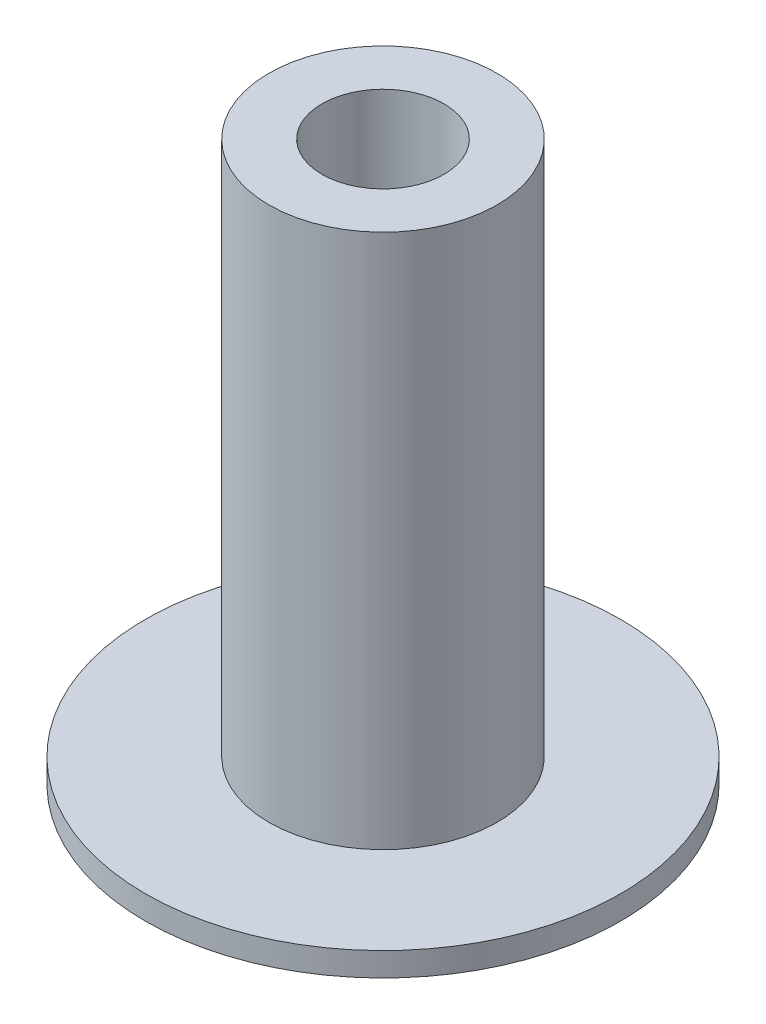
ISO-10303-21;
HEADER;
FILE_DESCRIPTION(('STEP AP214'),'2;1');
FILE_NAME('part.step','',(''),(''),'','','');
FILE_SCHEMA(('AUTOMOTIVE_DESIGN { 1 0 10303 214 1 1 1 1 }'));
ENDSEC;
DATA;
#1=APPLICATION_CONTEXT('core data for automotive mechanical design processes');
#2=APPLICATION_PROTOCOL_DEFINITION('international standard','automotive_design',2000,#1);
#3=PRODUCT_CONTEXT('',#1,'mechanical');
#4=PRODUCT('Part','Part','',(#3));
#5=PRODUCT_RELATED_PRODUCT_CATEGORY('part','',(#4));
#6=PRODUCT_DEFINITION_FORMATION('','',#4);
#7=PRODUCT_DEFINITION_CONTEXT('part definition',#1,'design');
#8=PRODUCT_DEFINITION('design','',#6,#7);
#9=PRODUCT_DEFINITION_SHAPE('','',#8);
#10=(LENGTH_UNIT() NAMED_UNIT(*) SI_UNIT(.MILLI.,.METRE.));
#11=(NAMED_UNIT(*) PLANE_ANGLE_UNIT() SI_UNIT($,.RADIAN.));
#12=(NAMED_UNIT(*) SI_UNIT($,.STERADIAN.) SOLID_ANGLE_UNIT());
#13=UNCERTAINTY_MEASURE_WITH_UNIT(LENGTH_MEASURE(1.E-05),#10,'distance_accuracy_value','');
#14=(GEOMETRIC_REPRESENTATION_CONTEXT(3) GLOBAL_UNCERTAINTY_ASSIGNED_CONTEXT((#13)) GLOBAL_UNIT_ASSIGNED_CONTEXT((#10,
#11,#12)) REPRESENTATION_CONTEXT('',''));
#15=CARTESIAN_POINT('',(0.,0.,0.));
#16=DIRECTION('',(0.,0.,1.));
#17=DIRECTION('',(1.,0.,0.));
#18=AXIS2_PLACEMENT_3D('',#15,#16,#17);
#19=CARTESIAN_POINT('',(0.,1.27,0.));
#20=DIRECTION('',(0.,-1.,0.));
#21=DIRECTION('',(0.,0.,-1.));
#22=AXIS2_PLACEMENT_3D('',#19,#20,#21);
#23=CYLINDRICAL_SURFACE('',#22,12.7);
#24=CARTESIAN_POINT('',(0.,1.27,0.));
#25=DIRECTION('',(0.,1.,0.));
#26=DIRECTION('',(0.,0.,1.));
#27=AXIS2_PLACEMENT_3D('',#24,#25,#26);
#28=CIRCLE('',#27,12.7);
#29=CARTESIAN_POINT('',(0.,1.27,12.7));
#30=VERTEX_POINT('',#29);
#31=EDGE_CURVE('E49',#30,#30,#28,.T.);
#32=ORIENTED_EDGE('',*,*,#31,.F.);
#33=EDGE_LOOP('',(#32));
#34=FACE_BOUND('',#33,.T.);
#35=CARTESIAN_POINT('',(0.,0.,0.));
#36=DIRECTION('',(0.,1.,0.));
#37=DIRECTION('',(0.,0.,1.));
#38=AXIS2_PLACEMENT_3D('',#35,#36,#37);
#39=CIRCLE('',#38,12.7);
#40=CARTESIAN_POINT('',(0.,0.,12.7));
#41=VERTEX_POINT('',#40);
#42=EDGE_CURVE('E44',#41,#41,#39,.T.);
#43=ORIENTED_EDGE('',*,*,#42,.T.);
#44=EDGE_LOOP('',(#43));
#45=FACE_BOUND('',#44,.T.);
#46=ADVANCED_FACE('F41',(#34,#45),#23,.T.);
#47=CARTESIAN_POINT('',(0.,1.27,0.));
#48=DIRECTION('',(0.,1.,0.));
#49=DIRECTION('',(0.,0.,1.));
#50=AXIS2_PLACEMENT_3D('',#47,#48,#49);
#51=PLANE('',#50);
#52=CARTESIAN_POINT('',(0.,1.27,0.));
#53=DIRECTION('',(0.,1.,0.));
#54=DIRECTION('',(0.,0.,1.));
#55=AXIS2_PLACEMENT_3D('',#52,#53,#54);
#56=CIRCLE('',#55,6.096);
#57=CARTESIAN_POINT('',(0.,1.27,6.096));
#58=VERTEX_POINT('',#57);
#59=EDGE_CURVE('E10',#58,#58,#56,.T.);
#60=ORIENTED_EDGE('',*,*,#59,.F.);
#61=EDGE_LOOP('',(#60));
#62=FACE_BOUND('',#61,.T.);
#63=ORIENTED_EDGE('',*,*,#31,.T.);
#64=EDGE_LOOP('',(#63));
#65=FACE_BOUND('',#64,.T.);
#66=ADVANCED_FACE('F84',(#62,#65),#51,.T.);
#67=CARTESIAN_POINT('',(0.,0.,0.));
#68=DIRECTION('',(0.,1.,0.));
#69=DIRECTION('',(0.,0.,1.));
#70=AXIS2_PLACEMENT_3D('',#67,#68,#69);
#71=PLANE('',#70);
#72=CARTESIAN_POINT('',(0.,0.,0.));
#73=DIRECTION('',(0.,1.,0.));
#74=DIRECTION('',(0.,0.,1.));
#75=AXIS2_PLACEMENT_3D('',#72,#73,#74);
#76=CIRCLE('',#75,3.26389999999999);
#77=CARTESIAN_POINT('',(0.,0.,3.26389999999999));
#78=VERTEX_POINT('',#77);
#79=EDGE_CURVE('E60',#78,#78,#76,.T.);
#80=ORIENTED_EDGE('',*,*,#79,.T.);
#81=EDGE_LOOP('',(#80));
#82=FACE_BOUND('',#81,.T.);
#83=ORIENTED_EDGE('',*,*,#42,.F.);
#84=EDGE_LOOP('',(#83));
#85=FACE_BOUND('',#84,.T.);
#86=ADVANCED_FACE('F79',(#82,#85),#71,.F.);
#87=CARTESIAN_POINT('',(0.,29.845,0.));
#88=DIRECTION('',(0.,-1.,0.));
#89=DIRECTION('',(0.,0.,-1.));
#90=AXIS2_PLACEMENT_3D('',#87,#88,#89);
#91=CYLINDRICAL_SURFACE('',#90,6.096);
#92=CARTESIAN_POINT('',(0.,29.845,0.));
#93=DIRECTION('',(0.,1.,0.));
#94=DIRECTION('',(0.,0.,1.));
#95=AXIS2_PLACEMENT_3D('',#92,#93,#94);
#96=CIRCLE('',#95,6.096);
#97=CARTESIAN_POINT('',(0.,29.845,6.096));
#98=VERTEX_POINT('',#97);
#99=EDGE_CURVE('E56',#98,#98,#96,.T.);
#100=ORIENTED_EDGE('',*,*,#99,.F.);
#101=EDGE_LOOP('',(#100));
#102=FACE_BOUND('',#101,.T.);
#103=ORIENTED_EDGE('',*,*,#59,.T.);
#104=EDGE_LOOP('',(#103));
#105=FACE_BOUND('',#104,.T.);
#106=ADVANCED_FACE('F74',(#102,#105),#91,.T.);
#107=CARTESIAN_POINT('',(0.,29.845,0.));
#108=DIRECTION('',(0.,1.,0.));
#109=DIRECTION('',(0.,0.,1.));
#110=AXIS2_PLACEMENT_3D('',#107,#108,#109);
#111=PLANE('',#110);
#112=CARTESIAN_POINT('',(0.,29.845,0.));
#113=DIRECTION('',(0.,1.,0.));
#114=DIRECTION('',(0.,0.,1.));
#115=AXIS2_PLACEMENT_3D('',#112,#113,#114);
#116=CIRCLE('',#115,3.26389999999999);
#117=CARTESIAN_POINT('',(0.,29.845,3.26389999999999));
#118=VERTEX_POINT('',#117);
#119=EDGE_CURVE('E64',#118,#118,#116,.T.);
#120=ORIENTED_EDGE('',*,*,#119,.F.);
#121=EDGE_LOOP('',(#120));
#122=FACE_BOUND('',#121,.T.);
#123=ORIENTED_EDGE('',*,*,#99,.T.);
#124=EDGE_LOOP('',(#123));
#125=FACE_BOUND('',#124,.T.);
#126=ADVANCED_FACE('F71',(#122,#125),#111,.T.);
#127=CARTESIAN_POINT('',(0.,29.845,0.));
#128=DIRECTION('',(0.,1.,0.));
#129=DIRECTION('',(0.,0.,1.));
#130=AXIS2_PLACEMENT_3D('',#127,#128,#129);
#131=CYLINDRICAL_SURFACE('',#130,3.26389999999999);
#132=ORIENTED_EDGE('',*,*,#79,.F.);
#133=EDGE_LOOP('',(#132));
#134=FACE_BOUND('',#133,.T.);
#135=ORIENTED_EDGE('',*,*,#119,.T.);
#136=EDGE_LOOP('',(#135));
#137=FACE_BOUND('',#136,.T.);
#138=ADVANCED_FACE('F69',(#134,#137),#131,.F.);
#139=CLOSED_SHELL('',(#46,#66,#86,#106,#126,#138));
#140=MANIFOLD_SOLID_BREP('B2',#139);
#141=ADVANCED_BREP_SHAPE_REPRESENTATION('',(#18,#140),#14);
#142=SHAPE_DEFINITION_REPRESENTATION(#9,#141);
ENDSEC;
END-ISO-10303-21;
